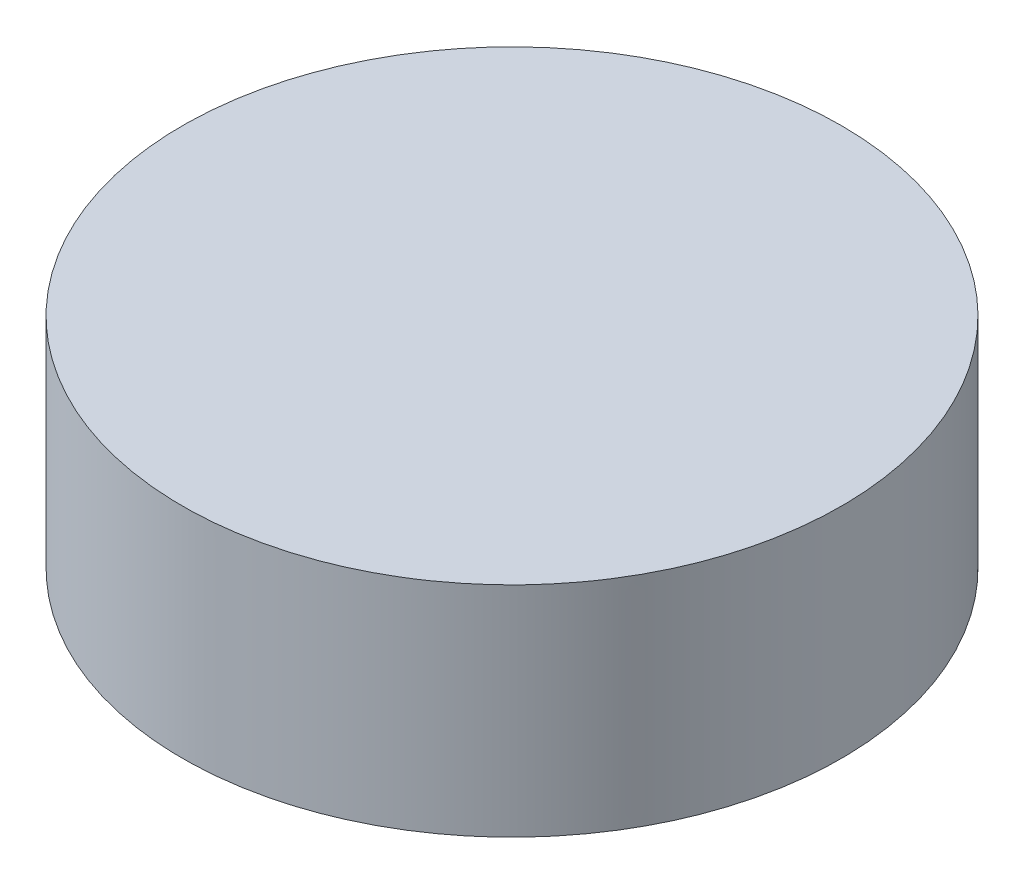
ISO-10303-21;
HEADER;
FILE_DESCRIPTION(('STEP AP214'),'2;1');
FILE_NAME('part.step','',(''),(''),'','','');
FILE_SCHEMA(('AUTOMOTIVE_DESIGN { 1 0 10303 214 1 1 1 1 }'));
ENDSEC;
DATA;
#1=APPLICATION_CONTEXT('core data for automotive mechanical design processes');
#2=APPLICATION_PROTOCOL_DEFINITION('international standard','automotive_design',2000,#1);
#3=PRODUCT_CONTEXT('',#1,'mechanical');
#4=PRODUCT('Part','Part','',(#3));
#5=PRODUCT_RELATED_PRODUCT_CATEGORY('part','',(#4));
#6=PRODUCT_DEFINITION_FORMATION('','',#4);
#7=PRODUCT_DEFINITION_CONTEXT('part definition',#1,'design');
#8=PRODUCT_DEFINITION('design','',#6,#7);
#9=PRODUCT_DEFINITION_SHAPE('','',#8);
#10=(LENGTH_UNIT() NAMED_UNIT(*) SI_UNIT(.MILLI.,.METRE.));
#11=(NAMED_UNIT(*) PLANE_ANGLE_UNIT() SI_UNIT($,.RADIAN.));
#12=(NAMED_UNIT(*) SI_UNIT($,.STERADIAN.) SOLID_ANGLE_UNIT());
#13=UNCERTAINTY_MEASURE_WITH_UNIT(LENGTH_MEASURE(1.E-05),#10,'distance_accuracy_value','');
#14=(GEOMETRIC_REPRESENTATION_CONTEXT(3) GLOBAL_UNCERTAINTY_ASSIGNED_CONTEXT((#13)) GLOBAL_UNIT_ASSIGNED_CONTEXT((#10,
#11,#12)) REPRESENTATION_CONTEXT('',''));
#15=CARTESIAN_POINT('',(0.,0.,0.));
#16=DIRECTION('',(0.,0.,1.));
#17=DIRECTION('',(1.,0.,0.));
#18=AXIS2_PLACEMENT_3D('',#15,#16,#17);
#19=CARTESIAN_POINT('',(0.0114478441370115,-3.55199237528108,110.876482128447));
#20=CARTESIAN_POINT('',(-0.156782135070628,-3.55199237528108,110.876482128447));
#21=CARTESIAN_POINT('',(-0.493242093485905,-3.55199237528108,110.943408175304));
#22=CARTESIAN_POINT('',(-0.921097563131417,-3.55199237528108,111.229292060238));
#23=CARTESIAN_POINT('',(-1.20698144806547,-3.55199237528109,111.657147529883));
#24=CARTESIAN_POINT('',(-1.30737051835074,-3.55199237528109,112.161837467506));
#25=CARTESIAN_POINT('',(-1.20698144806547,-3.55199237528109,112.666527405129));
#26=CARTESIAN_POINT('',(-0.921097563131417,-3.5519923752811,113.094382874775));
#27=CARTESIAN_POINT('',(-0.493242093485905,-3.5519923752811,113.380266759709));
#28=CARTESIAN_POINT('',(0.0114478441370119,-3.5519923752811,113.480655829994));
#29=CARTESIAN_POINT('',(0.516137781759928,-3.5519923752811,113.380266759709));
#30=CARTESIAN_POINT('',(0.943993251405441,-3.5519923752811,113.094382874775));
#31=CARTESIAN_POINT('',(1.22987713633949,-3.55199237528109,112.666527405129));
#32=CARTESIAN_POINT('',(1.33026620662476,-3.55199237528109,112.161837467506));
#33=CARTESIAN_POINT('',(1.22987713633949,-3.55199237528109,111.657147529883));
#34=CARTESIAN_POINT('',(0.94399325140544,-3.55199237528108,111.229292060238));
#35=CARTESIAN_POINT('',(0.516137781759928,-3.55199237528108,110.943408175304));
#36=CARTESIAN_POINT('',(0.179677823344651,-3.55199237528108,110.876482128447));
#37=CARTESIAN_POINT('',(0.0114478441370115,-3.55199237528108,110.876482128447));
#38=B_SPLINE_CURVE_WITH_KNOTS('',3,(#19,#20,#21,#22,#23,#24,#25,#26,#27,#28,#29,#30,#31,#32,#33,
#34,#35,#36,#37),.UNSPECIFIED.,.T.,.F.,(4,1,1,1,1,1,1,1,1,1,1,1,1,1,1,1,4),(0.,
0.0625000000000002,0.125,0.187499999999999,0.25,0.312500000000001,0.375,0.4375,0.5,0.5625,0.625,
0.6875,0.75,0.812500000000001,0.875,0.9375,1.),.UNSPECIFIED.);
#39=DIRECTION('',(0.,-1.,0.));
#40=VECTOR('',#39,1.);
#41=SURFACE_OF_LINEAR_EXTRUSION('',#38,#40);
#42=CARTESIAN_POINT('',(0.0114478441370115,-3.55199237528108,110.876482128447));
#43=CARTESIAN_POINT('',(0.0324770877263577,-3.55199237528108,110.876482113223));
#44=CARTESIAN_POINT('',(0.0535058948278921,-3.55199237528108,110.877005011041));
#45=CARTESIAN_POINT('',(0.0955134910884612,-3.55199237528108,110.879086515446));
#46=CARTESIAN_POINT('',(0.116492277232011,-3.55199237528108,110.880645182964));
#47=CARTESIAN_POINT('',(0.158349636616629,-3.55199237528108,110.884788249224));
#48=CARTESIAN_POINT('',(0.179228202881284,-3.55199237528108,110.887372718355));
#49=CARTESIAN_POINT('',(0.220835230034901,-3.55199237528108,110.893557445725));
#50=CARTESIAN_POINT('',(0.24156368441046,-3.55199237528108,110.897157747773));
#51=CARTESIAN_POINT('',(0.282820505320755,-3.55199237528108,110.905364239017));
#52=CARTESIAN_POINT('',(0.303348871855492,-3.55199237528108,110.909970428212));
#53=CARTESIAN_POINT('',(0.344155553389059,-3.55199237528108,110.920178809438));
#54=CARTESIAN_POINT('',(0.364433879134812,-3.55199237528108,110.9257809585));
#55=CARTESIAN_POINT('',(0.404690487158205,-3.55199237528108,110.937971366458));
#56=CARTESIAN_POINT('',(0.424668789930884,-3.55199237528108,110.944559557655));
#57=CARTESIAN_POINT('',(0.464275427181407,-3.55199237528108,110.958712168687));
#58=CARTESIAN_POINT('',(0.483903782178525,-3.55199237528108,110.966276531068));
#59=CARTESIAN_POINT('',(0.522760292015533,-3.55199237528108,110.982371424423));
#60=CARTESIAN_POINT('',(0.541988446855424,-3.55199237528108,110.990901955396));
#61=CARTESIAN_POINT('',(0.580001975896991,-3.55199237528108,111.008900669982));
#62=CARTESIAN_POINT('',(0.598787323982072,-3.55199237528108,111.018368908729));
#63=CARTESIAN_POINT('',(0.635872964512383,-3.55199237528108,111.038214708977));
#64=CARTESIAN_POINT('',(0.654173223579814,-3.55199237528108,111.048592332841));
#65=CARTESIAN_POINT('',(0.690246320861792,-3.55199237528108,111.070228599004));
#66=CARTESIAN_POINT('',(0.708019136292825,-3.55199237528108,111.081487279285));
#67=CARTESIAN_POINT('',(0.742994978010504,-3.55199237528108,111.104857389564));
#68=CARTESIAN_POINT('',(0.760198004297151,-3.55199237528108,111.116968819562));
#69=CARTESIAN_POINT('',(0.793991884448817,-3.55199237528108,111.142016175216));
#70=CARTESIAN_POINT('',(0.810582764685785,-3.55199237528108,111.154952065289));
#71=CARTESIAN_POINT('',(0.843109953551045,-3.55199237528108,111.181620070567));
#72=CARTESIAN_POINT('',(0.859046307021303,-3.55199237528108,111.19535213107));
#73=CARTESIAN_POINT('',(0.890222098809402,-3.55199237528108,111.223584242638));
#74=CARTESIAN_POINT('',(0.905461578071172,-3.55199237528108,111.238084248474));
#75=CARTESIAN_POINT('',(0.935201063169231,-3.55199237528108,111.267823733572));
#76=CARTESIAN_POINT('',(0.949701069005519,-3.55199237528109,111.283063212834));
#77=CARTESIAN_POINT('',(0.977933180573233,-3.55199237528109,111.314239004622));
#78=CARTESIAN_POINT('',(0.991665241076728,-3.55199237528108,111.330175358092));
#79=CARTESIAN_POINT('',(1.01833324635468,-3.55199237528108,111.362702546958));
#80=CARTESIAN_POINT('',(1.03126913642712,-3.55199237528109,111.379293427195));
#81=CARTESIAN_POINT('',(1.05631649208176,-3.55199237528109,111.413087307346));
#82=CARTESIAN_POINT('',(1.06842792207965,-3.55199237528109,111.430290333633));
#83=CARTESIAN_POINT('',(1.09179803235861,-3.55199237528109,111.46526617535));
#84=CARTESIAN_POINT('',(1.10305671263967,-3.55199237528109,111.483038990781));
#85=CARTESIAN_POINT('',(1.12469297880236,-3.55199237528109,111.519112088064));
#86=CARTESIAN_POINT('',(1.13507060266602,-3.55199237528109,111.537412347131));
#87=CARTESIAN_POINT('',(1.15491640291466,-3.55199237528109,111.574497987661));
#88=CARTESIAN_POINT('',(1.16438464166178,-3.55199237528109,111.593283335745));
#89=CARTESIAN_POINT('',(1.18238335624699,-3.55199237528109,111.63129686479));
#90=CARTESIAN_POINT('',(1.19091388722032,-3.55199237528109,111.650525019635));
#91=CARTESIAN_POINT('',(1.20700878057574,-3.55199237528109,111.689381529458));
#92=CARTESIAN_POINT('',(1.21457314295784,-3.55199237528109,111.709009884437));
#93=CARTESIAN_POINT('',(1.22872575398666,-3.55199237528109,111.748616521737));
#94=CARTESIAN_POINT('',(1.23531394517966,-3.55199237528109,111.768594824578));
#95=CARTESIAN_POINT('',(1.24750435314872,-3.55199237528109,111.808851432415));
#96=CARTESIAN_POINT('',(1.25310650222642,-3.55199237528109,111.829129757906));
#97=CARTESIAN_POINT('',(1.2633148834099,-3.55199237528109,111.869936440136));
#98=CARTESIAN_POINT('',(1.26792107254794,-3.55199237528109,111.890464807622));
#99=CARTESIAN_POINT('',(1.27612756394884,-3.55199237528109,111.931721625933));
#100=CARTESIAN_POINT('',(1.2797278662117,-3.55199237528109,111.952450076759));
#101=CARTESIAN_POINT('',(1.28591259299537,-3.55199237528109,111.994057113611));
#102=CARTESIAN_POINT('',(1.28849706132588,-3.55199237528109,112.014935693123));
#103=CARTESIAN_POINT('',(1.29264012977268,-3.55199237528109,112.056793016316));
#104=CARTESIAN_POINT('',(1.2941988002772,-3.55199237528109,112.077771753024));
#105=CARTESIAN_POINT('',(1.29628029652268,-3.55199237528109,112.119779484343));
#106=CARTESIAN_POINT('',(1.29680318319634,-3.55199237528109,112.140808475924));
#107=CARTESIAN_POINT('',(1.29680318319634,-3.55199237528109,112.182866459088));
#108=CARTESIAN_POINT('',(1.29628029652268,-3.55199237528109,112.20389545067));
#109=CARTESIAN_POINT('',(1.2941988002772,-3.55199237528109,112.245903181989));
#110=CARTESIAN_POINT('',(1.29264012977268,-3.55199237528109,112.266881918697));
#111=CARTESIAN_POINT('',(1.28849706132588,-3.55199237528109,112.308739241889));
#112=CARTESIAN_POINT('',(1.28591259299537,-3.55199237528109,112.329617821401));
#113=CARTESIAN_POINT('',(1.2797278662117,-3.55199237528109,112.371224858254));
#114=CARTESIAN_POINT('',(1.27612756394884,-3.55199237528109,112.391953309079));
#115=CARTESIAN_POINT('',(1.26792107254794,-3.55199237528109,112.433210127391));
#116=CARTESIAN_POINT('',(1.2633148834099,-3.55199237528109,112.453738494877));
#117=CARTESIAN_POINT('',(1.25310650222642,-3.55199237528109,112.494545177107));
#118=CARTESIAN_POINT('',(1.24750435314872,-3.55199237528109,112.514823502597));
#119=CARTESIAN_POINT('',(1.23531394517966,-3.55199237528109,112.555080110434));
#120=CARTESIAN_POINT('',(1.22872575398666,-3.55199237528109,112.575058413275));
#121=CARTESIAN_POINT('',(1.21457314295784,-3.55199237528109,112.614665050576));
#122=CARTESIAN_POINT('',(1.20700878057574,-3.55199237528109,112.634293405555));
#123=CARTESIAN_POINT('',(1.19091388722032,-3.55199237528109,112.673149915378));
#124=CARTESIAN_POINT('',(1.18238335624698,-3.55199237528109,112.692378070223));
#125=CARTESIAN_POINT('',(1.16438464166178,-3.5519923752811,112.730391599268));
#126=CARTESIAN_POINT('',(1.15491640291466,-3.55199237528109,112.749176947352));
#127=CARTESIAN_POINT('',(1.13507060266602,-3.5519923752811,112.786262587881));
#128=CARTESIAN_POINT('',(1.12469297880236,-3.5519923752811,112.804562846949));
#129=CARTESIAN_POINT('',(1.10305671263967,-3.5519923752811,112.840635944231));
#130=CARTESIAN_POINT('',(1.0917980323586,-3.5519923752811,112.858408759662));
#131=CARTESIAN_POINT('',(1.06842792207965,-3.5519923752811,112.89338460138));
#132=CARTESIAN_POINT('',(1.05631649208177,-3.5519923752811,112.910587627666));
#133=CARTESIAN_POINT('',(1.03126913642712,-3.5519923752811,112.944381507818));
#134=CARTESIAN_POINT('',(1.01833324635468,-3.5519923752811,112.960972388055));
#135=CARTESIAN_POINT('',(0.991665241076728,-3.5519923752811,112.99349957692));
#136=CARTESIAN_POINT('',(0.977933180573234,-3.5519923752811,113.009435930391));
#137=CARTESIAN_POINT('',(0.949701069005518,-3.5519923752811,113.040611722179));
#138=CARTESIAN_POINT('',(0.935201063169227,-3.5519923752811,113.05585120144));
#139=CARTESIAN_POINT('',(0.90546157807117,-3.5519923752811,113.085590686539));
#140=CARTESIAN_POINT('',(0.890222098809404,-3.5519923752811,113.100090692375));
#141=CARTESIAN_POINT('',(0.859046307021305,-3.5519923752811,113.128322803943));
#142=CARTESIAN_POINT('',(0.843109953551044,-3.5519923752811,113.142054864446));
#143=CARTESIAN_POINT('',(0.810582764685785,-3.5519923752811,113.168722869724));
#144=CARTESIAN_POINT('',(0.793991884448821,-3.5519923752811,113.181658759796));
#145=CARTESIAN_POINT('',(0.760198004297139,-3.5519923752811,113.206706115451));
#146=CARTESIAN_POINT('',(0.742994978010473,-3.5519923752811,113.218817545449));
#147=CARTESIAN_POINT('',(0.708019136292863,-3.5519923752811,113.242187655728));
#148=CARTESIAN_POINT('',(0.690246320861919,-3.5519923752811,113.253446336009));
#149=CARTESIAN_POINT('',(0.65417322357968,-3.5519923752811,113.275082602172));
#150=CARTESIAN_POINT('',(0.635872964511899,-3.5519923752811,113.285460226035));
#151=CARTESIAN_POINT('',(0.598787323982552,-3.5519923752811,113.305306026284));
#152=CARTESIAN_POINT('',(0.580001975898786,-3.5519923752811,113.314774265031));
#153=CARTESIAN_POINT('',(0.54198844685363,-3.5519923752811,113.332772979616));
#154=CARTESIAN_POINT('',(0.522760292008837,-3.5519923752811,113.34130351059));
#155=CARTESIAN_POINT('',(0.483903782185219,-3.5519923752811,113.357398403945));
#156=CARTESIAN_POINT('',(0.464275427206395,-3.5519923752811,113.364962766327));
#157=CARTESIAN_POINT('',(0.42466878990589,-3.5519923752811,113.379115377356));
#158=CARTESIAN_POINT('',(0.40469048706493,-3.5519923752811,113.385703568549));
#159=CARTESIAN_POINT('',(0.364433879228095,-3.5519923752811,113.397893976518));
#160=CARTESIAN_POINT('',(0.344155553737201,-3.5519923752811,113.403496125596));
#161=CARTESIAN_POINT('',(0.303348871507334,-3.5519923752811,113.413704506779));
#162=CARTESIAN_POINT('',(0.282820504021385,-3.5519923752811,113.418310695917));
#163=CARTESIAN_POINT('',(0.241563685709829,-3.5519923752811,113.426517187318));
#164=CARTESIAN_POINT('',(0.220835234884221,-3.5519923752811,113.430117489581));
#165=CARTESIAN_POINT('',(0.179228198032172,-3.5519923752811,113.436302216365));
#166=CARTESIAN_POINT('',(0.158349618519858,-3.5519923752811,113.438886684695));
#167=CARTESIAN_POINT('',(0.116492295327541,-3.5519923752811,113.443029753142));
#168=CARTESIAN_POINT('',(0.0955135586196486,-3.5519923752811,113.444588423647));
#169=CARTESIAN_POINT('',(0.0535058273006771,-3.5519923752811,113.446669919892));
#170=CARTESIAN_POINT('',(0.0324768357188443,-3.5519923752811,113.447192806566));
#171=CARTESIAN_POINT('',(-0.00958114744482144,-3.5519923752811,113.447192806566));
#172=CARTESIAN_POINT('',(-0.0306101390266544,-3.5519923752811,113.446669919892));
#173=CARTESIAN_POINT('',(-0.0726178703456255,-3.5519923752811,113.444588423647));
#174=CARTESIAN_POINT('',(-0.0935966070535172,-3.5519923752811,113.443029753142));
#175=CARTESIAN_POINT('',(-0.135453930245835,-3.5519923752811,113.438886684695));
#176=CARTESIAN_POINT('',(-0.156332509758149,-3.5519923752811,113.436302216365));
#177=CARTESIAN_POINT('',(-0.197939546610199,-3.5519923752811,113.430117489581));
#178=CARTESIAN_POINT('',(-0.218667997435807,-3.5519923752811,113.426517187318));
#179=CARTESIAN_POINT('',(-0.259924815747362,-3.5519923752811,113.418310695917));
#180=CARTESIAN_POINT('',(-0.28045318323331,-3.5519923752811,113.413704506779));
#181=CARTESIAN_POINT('',(-0.321259865463177,-3.5519923752811,113.403496125596));
#182=CARTESIAN_POINT('',(-0.341538190954072,-3.5519923752811,113.397893976518));
#183=CARTESIAN_POINT('',(-0.381794798790908,-3.5519923752811,113.385703568549));
#184=CARTESIAN_POINT('',(-0.401773101631868,-3.5519923752811,113.379115377356));
#185=CARTESIAN_POINT('',(-0.441379738932373,-3.5519923752811,113.364962766327));
#186=CARTESIAN_POINT('',(-0.461008093911197,-3.5519923752811,113.357398403945));
#187=CARTESIAN_POINT('',(-0.499864603734814,-3.5519923752811,113.34130351059));
#188=CARTESIAN_POINT('',(-0.519092758579608,-3.5519923752811,113.332772979616));
#189=CARTESIAN_POINT('',(-0.557106287624764,-3.5519923752811,113.314774265031));
#190=CARTESIAN_POINT('',(-0.575891635708531,-3.5519923752811,113.305306026284));
#191=CARTESIAN_POINT('',(-0.612977276237877,-3.5519923752811,113.285460226035));
#192=CARTESIAN_POINT('',(-0.631277535305657,-3.5519923752811,113.275082602172));
#193=CARTESIAN_POINT('',(-0.667350632587895,-3.5519923752811,113.253446336009));
#194=CARTESIAN_POINT('',(-0.68512344801884,-3.5519923752811,113.242187655728));
#195=CARTESIAN_POINT('',(-0.720099289736451,-3.5519923752811,113.218817545449));
#196=CARTESIAN_POINT('',(-0.737302316023117,-3.5519923752811,113.206706115451));
#197=CARTESIAN_POINT('',(-0.771096196174797,-3.5519923752811,113.181658759796));
#198=CARTESIAN_POINT('',(-0.787687076411761,-3.5519923752811,113.168722869724));
#199=CARTESIAN_POINT('',(-0.82021426527702,-3.5519923752811,113.142054864446));
#200=CARTESIAN_POINT('',(-0.836150618747282,-3.5519923752811,113.128322803943));
#201=CARTESIAN_POINT('',(-0.86732641053538,-3.5519923752811,113.100090692375));
#202=CARTESIAN_POINT('',(-0.882565889797145,-3.5519923752811,113.085590686539));
#203=CARTESIAN_POINT('',(-0.912305374895204,-3.5519923752811,113.05585120144));
#204=CARTESIAN_POINT('',(-0.926805380731497,-3.5519923752811,113.040611722179));
#205=CARTESIAN_POINT('',(-0.955037492299213,-3.5519923752811,113.009435930391));
#206=CARTESIAN_POINT('',(-0.968769552802705,-3.5519923752811,112.99349957692));
#207=CARTESIAN_POINT('',(-0.995437558080657,-3.5519923752811,112.960972388055));
#208=CARTESIAN_POINT('',(-1.0083734481531,-3.5519923752811,112.944381507818));
#209=CARTESIAN_POINT('',(-1.03342080380774,-3.5519923752811,112.910587627666));
#210=CARTESIAN_POINT('',(-1.04553223380563,-3.5519923752811,112.89338460138));
#211=CARTESIAN_POINT('',(-1.06890234408458,-3.5519923752811,112.858408759662));
#212=CARTESIAN_POINT('',(-1.08016102436565,-3.5519923752811,112.840635944231));
#213=CARTESIAN_POINT('',(-1.10179729052834,-3.5519923752811,112.804562846949));
#214=CARTESIAN_POINT('',(-1.112174914392,-3.5519923752811,112.786262587881));
#215=CARTESIAN_POINT('',(-1.13202071464064,-3.55199237528109,112.749176947352));
#216=CARTESIAN_POINT('',(-1.14148895338776,-3.55199237528109,112.730391599268));
#217=CARTESIAN_POINT('',(-1.15948766797297,-3.55199237528109,112.692378070223));
#218=CARTESIAN_POINT('',(-1.1680181989463,-3.55199237528109,112.673149915378));
#219=CARTESIAN_POINT('',(-1.18411309230172,-3.55199237528109,112.634293405555));
#220=CARTESIAN_POINT('',(-1.19167745468381,-3.55199237528109,112.614665050576));
#221=CARTESIAN_POINT('',(-1.20583006571263,-3.55199237528109,112.575058413275));
#222=CARTESIAN_POINT('',(-1.21241825690564,-3.55199237528109,112.555080110434));
#223=CARTESIAN_POINT('',(-1.22460866487469,-3.55199237528109,112.514823502597));
#224=CARTESIAN_POINT('',(-1.2302108139524,-3.55199237528109,112.494545177107));
#225=CARTESIAN_POINT('',(-1.24041919513587,-3.55199237528109,112.453738494877));
#226=CARTESIAN_POINT('',(-1.24502538427392,-3.55199237528109,112.433210127391));
#227=CARTESIAN_POINT('',(-1.25323187567482,-3.55199237528109,112.391953309079));
#228=CARTESIAN_POINT('',(-1.25683217793768,-3.55199237528109,112.371224858254));
#229=CARTESIAN_POINT('',(-1.26301690472135,-3.55199237528109,112.329617821401));
#230=CARTESIAN_POINT('',(-1.26560137305186,-3.55199237528109,112.308739241889));
#231=CARTESIAN_POINT('',(-1.26974444149866,-3.55199237528109,112.266881918697));
#232=CARTESIAN_POINT('',(-1.27130311200318,-3.55199237528109,112.245903181989));
#233=CARTESIAN_POINT('',(-1.27338460824866,-3.55199237528109,112.20389545067));
#234=CARTESIAN_POINT('',(-1.27390749492232,-3.55199237528109,112.182866459088));
#235=CARTESIAN_POINT('',(-1.27390749492232,-3.55199237528109,112.140808475924));
#236=CARTESIAN_POINT('',(-1.27338460824866,-3.55199237528109,112.119779484343));
#237=CARTESIAN_POINT('',(-1.27130311200318,-3.55199237528109,112.077771753024));
#238=CARTESIAN_POINT('',(-1.26974444149866,-3.55199237528109,112.056793016316));
#239=CARTESIAN_POINT('',(-1.26560137305186,-3.55199237528109,112.014935693123));
#240=CARTESIAN_POINT('',(-1.26301690472135,-3.55199237528109,111.994057113611));
#241=CARTESIAN_POINT('',(-1.25683217793768,-3.55199237528109,111.952450076759));
#242=CARTESIAN_POINT('',(-1.25323187567482,-3.55199237528109,111.931721625934));
#243=CARTESIAN_POINT('',(-1.24502538427392,-3.55199237528109,111.890464807622));
#244=CARTESIAN_POINT('',(-1.24041919513587,-3.55199237528109,111.869936440136));
#245=CARTESIAN_POINT('',(-1.23021081395239,-3.55199237528109,111.829129757906));
#246=CARTESIAN_POINT('',(-1.22460866487469,-3.55199237528109,111.808851432415));
#247=CARTESIAN_POINT('',(-1.21241825690564,-3.55199237528109,111.768594824578));
#248=CARTESIAN_POINT('',(-1.20583006571264,-3.55199237528109,111.748616521737));
#249=CARTESIAN_POINT('',(-1.19167745468382,-3.55199237528109,111.709009884437));
#250=CARTESIAN_POINT('',(-1.18411309230172,-3.55199237528109,111.689381529458));
#251=CARTESIAN_POINT('',(-1.16801819894629,-3.55199237528109,111.650525019634));
#252=CARTESIAN_POINT('',(-1.15948766797296,-3.55199237528109,111.63129686479));
#253=CARTESIAN_POINT('',(-1.14148895338776,-3.55199237528109,111.593283335745));
#254=CARTESIAN_POINT('',(-1.13202071464064,-3.55199237528109,111.574497987661));
#255=CARTESIAN_POINT('',(-1.112174914392,-3.55199237528109,111.537412347131));
#256=CARTESIAN_POINT('',(-1.10179729052834,-3.55199237528109,111.519112088064));
#257=CARTESIAN_POINT('',(-1.08016102436565,-3.55199237528109,111.483038990781));
#258=CARTESIAN_POINT('',(-1.06890234408458,-3.55199237528109,111.46526617535));
#259=CARTESIAN_POINT('',(-1.04553223380563,-3.55199237528108,111.430290333633));
#260=CARTESIAN_POINT('',(-1.03342080380774,-3.55199237528108,111.413087307346));
#261=CARTESIAN_POINT('',(-1.00837344815309,-3.55199237528108,111.379293427194));
#262=CARTESIAN_POINT('',(-0.995437558080657,-3.55199237528108,111.362702546958));
#263=CARTESIAN_POINT('',(-0.968769552802705,-3.55199237528108,111.330175358092));
#264=CARTESIAN_POINT('',(-0.955037492299211,-3.55199237528108,111.314239004622));
#265=CARTESIAN_POINT('',(-0.926805380731496,-3.55199237528108,111.283063212834));
#266=CARTESIAN_POINT('',(-0.912305374895206,-3.55199237528108,111.267823733572));
#267=CARTESIAN_POINT('',(-0.882565889797147,-3.55199237528108,111.238084248474));
#268=CARTESIAN_POINT('',(-0.867326410535378,-3.55199237528108,111.223584242638));
#269=CARTESIAN_POINT('',(-0.83615061874728,-3.55199237528108,111.19535213107));
#270=CARTESIAN_POINT('',(-0.820214265277021,-3.55199237528108,111.181620070567));
#271=CARTESIAN_POINT('',(-0.787687076411761,-3.55199237528108,111.154952065289));
#272=CARTESIAN_POINT('',(-0.771096196174792,-3.55199237528108,111.142016175216));
#273=CARTESIAN_POINT('',(-0.737302316023128,-3.55199237528108,111.116968819562));
#274=CARTESIAN_POINT('',(-0.720099289736484,-3.55199237528108,111.104857389564));
#275=CARTESIAN_POINT('',(-0.685123448018802,-3.55199237528108,111.081487279285));
#276=CARTESIAN_POINT('',(-0.667350632587765,-3.55199237528108,111.070228599004));
#277=CARTESIAN_POINT('',(-0.631277535305787,-3.55199237528108,111.048592332841));
#278=CARTESIAN_POINT('',(-0.612977276238361,-3.55199237528108,111.038214708977));
#279=CARTESIAN_POINT('',(-0.57589163570805,-3.55199237528108,111.018368908729));
#280=CARTESIAN_POINT('',(-0.557106287622966,-3.55199237528108,111.008900669982));
#281=CARTESIAN_POINT('',(-0.519092758581397,-3.55199237528108,110.990901955396));
#282=CARTESIAN_POINT('',(-0.499864603741508,-3.55199237528108,110.982371424423));
#283=CARTESIAN_POINT('',(-0.461008093904503,-3.55199237528108,110.966276531068));
#284=CARTESIAN_POINT('',(-0.441379738907387,-3.55199237528108,110.958712168687));
#285=CARTESIAN_POINT('',(-0.401773101656862,-3.55199237528108,110.944559557655));
#286=CARTESIAN_POINT('',(-0.38179479888418,-3.55199237528108,110.937971366458));
#287=CARTESIAN_POINT('',(-0.341538190860787,-3.55199237528108,110.9257809585));
#288=CARTESIAN_POINT('',(-0.321259865115035,-3.55199237528108,110.920178809438));
#289=CARTESIAN_POINT('',(-0.28045318358147,-3.55199237528108,110.909970428212));
#290=CARTESIAN_POINT('',(-0.259924817046732,-3.55199237528108,110.905364239017));
#291=CARTESIAN_POINT('',(-0.218667996136436,-3.55199237528108,110.897157747773));
#292=CARTESIAN_POINT('',(-0.197939541760877,-3.55199237528108,110.893557445725));
#293=CARTESIAN_POINT('',(-0.156332514607261,-3.55199237528108,110.887372718355));
#294=CARTESIAN_POINT('',(-0.135453948342606,-3.55199237528108,110.884788249224));
#295=CARTESIAN_POINT('',(-0.0935965889579886,-3.55199237528108,110.880645182964));
#296=CARTESIAN_POINT('',(-0.072617802814438,-3.55199237528108,110.879086515446));
#297=CARTESIAN_POINT('',(-0.0306102065538682,-3.55199237528108,110.877005011041));
#298=CARTESIAN_POINT('',(-0.00958139945233351,-3.55199237528108,110.876482113223));
#299=CARTESIAN_POINT('',(0.0114478441370115,-3.55199237528108,110.876482128447));
#300=B_SPLINE_CURVE_WITH_KNOTS('',3,(#42,#43,#44,#45,#46,#47,#48,#49,#50,#51,#52,#53,#54,#55,
#56,#57,#58,#59,#60,#61,#62,#63,#64,#65,#66,#67,#68,#69,#70,#71,#72,#73,#74,#75,#76,#77,#78,#79,
#80,#81,#82,#83,#84,#85,#86,#87,#88,#89,#90,#91,#92,#93,#94,#95,#96,#97,#98,#99,#100,#101,#102,
#103,#104,#105,#106,#107,#108,#109,#110,#111,#112,#113,#114,#115,#116,#117,#118,#119,#120,#121,
#122,#123,#124,#125,#126,#127,#128,#129,#130,#131,#132,#133,#134,#135,#136,#137,#138,#139,#140,
#141,#142,#143,#144,#145,#146,#147,#148,#149,#150,#151,#152,#153,#154,#155,#156,#157,#158,#159,
#160,#161,#162,#163,#164,#165,#166,#167,#168,#169,#170,#171,#172,#173,#174,#175,#176,#177,#178,
#179,#180,#181,#182,#183,#184,#185,#186,#187,#188,#189,#190,#191,#192,#193,#194,#195,#196,#197,
#198,#199,#200,#201,#202,#203,#204,#205,#206,#207,#208,#209,#210,#211,#212,#213,#214,#215,#216,
#217,#218,#219,#220,#221,#222,#223,#224,#225,#226,#227,#228,#229,#230,#231,#232,#233,#234,#235,
#236,#237,#238,#239,#240,#241,#242,#243,#244,#245,#246,#247,#248,#249,#250,#251,#252,#253,#254,
#255,#256,#257,#258,#259,#260,#261,#262,#263,#264,#265,#266,#267,#268,#269,#270,#271,#272,#273,
#274,#275,#276,#277,#278,#279,#280,#281,#282,#283,#284,#285,#286,#287,#288,#289,#290,#291,#292,
#293,#294,#295,#296,#297,#298,#299),.UNSPECIFIED.,.F.,.F.,(4,2,2,2,2,2,2,2,2,2,2,2,2,2,2,2,2,2,
2,2,2,2,2,2,2,2,2,2,2,2,2,2,2,2,2,2,2,2,2,2,2,2,2,2,2,2,2,2,2,2,2,2,2,2,2,2,2,2,2,2,2,2,2,2,2,2,
2,2,2,2,2,2,2,2,2,2,2,2,2,2,2,2,2,2,2,2,2,2,2,2,2,2,2,2,2,2,2,2,2,2,2,2,2,2,2,2,2,2,2,2,2,2,2,2,
2,2,2,2,2,2,2,2,2,2,2,2,2,2,4),(0.,0.063080612799078,0.12616493680959,0.189253590290849,
0.252344965001653,0.315436339712458,0.378524993193721,0.441609317204233,0.504689930003308,
0.567770542802388,0.630854866812899,0.693943520294152,0.757034895004971,0.820126269715768,
0.88321492319703,0.946299247207545,1.00937986000661,1.07246047280571,1.13554479681622,
1.19863345029747,1.26172482500827,1.32481619971908,1.38790485320035,1.45098917721087,
1.51406979000994,1.57715040280902,1.64023472681954,1.70332338030078,1.7664147550116,
1.8295061297224,1.89259478320368,1.95567910721416,2.01875972001324,2.08184033281232,
2.14492465682283,2.20801331030409,2.27110468501489,2.3341960597257,2.39728471320696,
2.46036903721749,2.52344965001656,2.58653026281562,2.64961458682615,2.71270324030741,
2.77579461501821,2.83888598972904,2.90197464321029,2.96505896722079,3.02813958001987,
3.09122019281895,3.15430451682946,3.21739317031071,3.28048454502153,3.34357591973233,
3.40666457321358,3.4697488972241,3.53282951002317,3.59591012282224,3.65899444683277,
3.72208310031403,3.78517447502483,3.84826584973564,3.9113545032169,3.97443882722741,
4.03751944002649,4.10060005282557,4.16368437683608,4.22677303031733,4.28986440502814,
4.35295577973895,4.41604443322021,4.47912875723072,4.54220937002979,4.60528998282887,
4.66837430683939,4.73146296032065,4.79455433503145,4.85764570974226,4.92073436322352,
4.98381868723402,5.0468993000331,5.10997991283217,5.17306423684269,5.23615289032394,
5.29924426503475,5.36233563974556,5.42542429322681,5.48850861723732,5.55158923003641,
5.61466984283549,5.67775416684599,5.74084282032726,5.80393419503806,5.86702556974886,
5.93011422323012,5.99319854724065,6.05627916003972,6.1193597728388,6.18244409684932,
6.24553275033057,6.30862412504138,6.3717154997522,6.43480415323347,6.497888477244,
6.56096909004305,6.62404970284214,6.68713402685266,6.75022268033391,6.81331405504474,
6.87640542975554,6.93949408323679,7.0025784072473,7.06565902004638,7.12873963284545,
7.19182395685597,7.25491261033723,7.31800398504803,7.38109535975883,7.44418401324009,
7.50726833725059,7.57034895004968,7.63342956284876,7.69651388685926,7.75960254034053,
7.82269391505134,7.88578528976214,7.9488739432434,8.01195826725391,8.07503888005299),.UNSPECIFIED.);
#301=CARTESIAN_POINT('',(0.0114478441370115,-3.55199237528108,110.876482128447));
#302=VERTEX_POINT('',#301);
#303=EDGE_CURVE('E9',#302,#302,#300,.F.);
#304=ORIENTED_EDGE('',*,*,#303,.F.);
#305=EDGE_LOOP('',(#304));
#306=FACE_BOUND('',#305,.T.);
#307=CARTESIAN_POINT('',(0.0114478441370115,-4.40444467387562,110.876482128447));
#308=CARTESIAN_POINT('',(-0.156782135070628,-4.40444467387562,110.876482128447));
#309=CARTESIAN_POINT('',(-0.493242093485905,-4.40444467387562,110.943408175304));
#310=CARTESIAN_POINT('',(-0.921097563131417,-4.40444467387562,111.229292060238));
#311=CARTESIAN_POINT('',(-1.20698144806547,-4.40444467387563,111.657147529883));
#312=CARTESIAN_POINT('',(-1.30737051835074,-4.40444467387563,112.161837467506));
#313=CARTESIAN_POINT('',(-1.20698144806547,-4.40444467387563,112.666527405129));
#314=CARTESIAN_POINT('',(-0.921097563131417,-4.40444467387564,113.094382874775));
#315=CARTESIAN_POINT('',(-0.493242093485905,-4.40444467387564,113.380266759709));
#316=CARTESIAN_POINT('',(0.0114478441370119,-4.40444467387564,113.480655829994));
#317=CARTESIAN_POINT('',(0.516137781759928,-4.40444467387564,113.380266759709));
#318=CARTESIAN_POINT('',(0.943993251405441,-4.40444467387564,113.094382874775));
#319=CARTESIAN_POINT('',(1.22987713633949,-4.40444467387563,112.666527405129));
#320=CARTESIAN_POINT('',(1.33026620662476,-4.40444467387563,112.161837467506));
#321=CARTESIAN_POINT('',(1.22987713633949,-4.40444467387563,111.657147529883));
#322=CARTESIAN_POINT('',(0.94399325140544,-4.40444467387562,111.229292060238));
#323=CARTESIAN_POINT('',(0.516137781759928,-4.40444467387562,110.943408175304));
#324=CARTESIAN_POINT('',(0.179677823344651,-4.40444467387562,110.876482128447));
#325=CARTESIAN_POINT('',(0.0114478441370115,-4.40444467387562,110.876482128447));
#326=B_SPLINE_CURVE_WITH_KNOTS('',3,(#307,#308,#309,#310,#311,#312,#313,#314,#315,#316,#317,
#318,#319,#320,#321,#322,#323,#324,#325),.UNSPECIFIED.,.T.,.F.,(4,1,1,1,1,1,1,1,1,1,1,1,1,1,1,1,
4),(0.,0.0625000000000002,0.125,0.187499999999999,0.25,0.312500000000001,0.375,0.4375,0.5,
0.5625,0.625,0.6875,0.75,0.812500000000001,0.875,0.9375,1.),.UNSPECIFIED.);
#327=CARTESIAN_POINT('',(0.0114478441370115,-4.40444467387562,110.876482128447));
#328=VERTEX_POINT('',#327);
#329=EDGE_CURVE('E24',#328,#328,#326,.T.);
#330=ORIENTED_EDGE('',*,*,#329,.T.);
#331=EDGE_LOOP('',(#330));
#332=FACE_BOUND('',#331,.T.);
#333=ADVANCED_FACE('F14',(#306,#332),#41,.F.);
#334=CARTESIAN_POINT('',(16.761447844137,-3.55199237528119,126.161837467506));
#335=DIRECTION('',(0.,-1.,0.));
#336=DIRECTION('',(1.,0.,0.));
#337=AXIS2_PLACEMENT_3D('',#334,#335,#336);
#338=PLANE('',#337);
#339=ORIENTED_EDGE('',*,*,#303,.T.);
#340=EDGE_LOOP('',(#339));
#341=FACE_BOUND('',#340,.T.);
#342=ADVANCED_FACE('F59',(#341),#338,.F.);
#343=CARTESIAN_POINT('',(16.761447844137,-4.40444467387573,126.161837467506));
#344=DIRECTION('',(0.,-1.,0.));
#345=DIRECTION('',(1.,0.,0.));
#346=AXIS2_PLACEMENT_3D('',#343,#344,#345);
#347=PLANE('',#346);
#348=ORIENTED_EDGE('',*,*,#329,.F.);
#349=EDGE_LOOP('',(#348));
#350=FACE_BOUND('',#349,.T.);
#351=ADVANCED_FACE('F67',(#350),#347,.T.);
#352=CLOSED_SHELL('',(#333,#342,#351));
#353=MANIFOLD_SOLID_BREP('B1',#352);
#354=ADVANCED_BREP_SHAPE_REPRESENTATION('',(#18,#353),#14);
#355=SHAPE_DEFINITION_REPRESENTATION(#9,#354);
ENDSEC;
END-ISO-10303-21;
